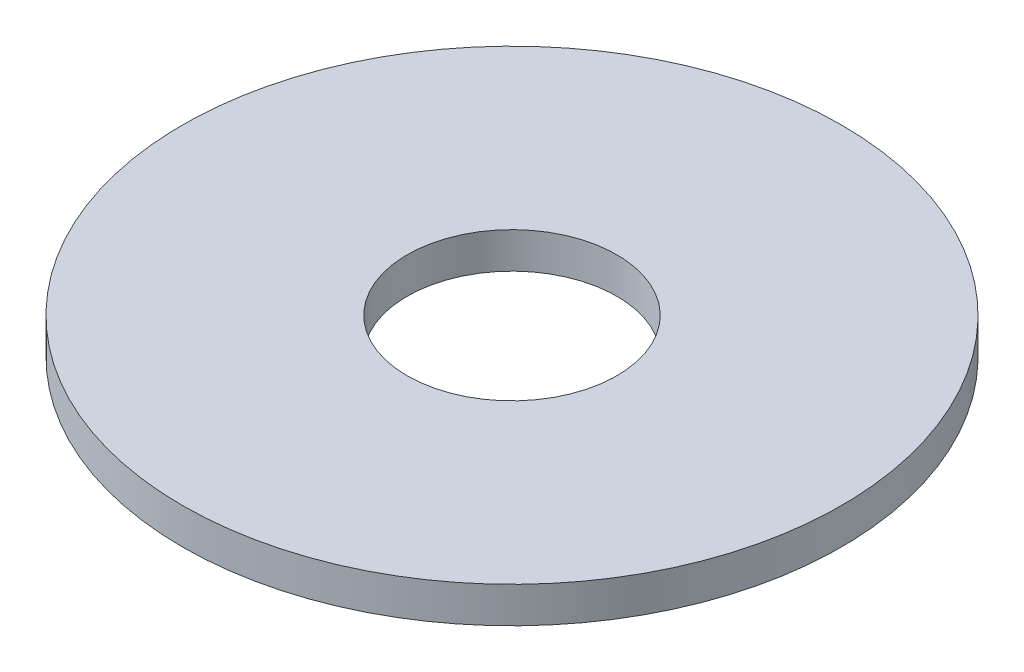
ISO-10303-21;
HEADER;
FILE_DESCRIPTION(('STEP AP214'),'2;1');
FILE_NAME('part.step','',(''),(''),'','','');
FILE_SCHEMA(('AUTOMOTIVE_DESIGN { 1 0 10303 214 1 1 1 1 }'));
ENDSEC;
DATA;
#1=APPLICATION_CONTEXT('core data for automotive mechanical design processes');
#2=APPLICATION_PROTOCOL_DEFINITION('international standard','automotive_design',2000,#1);
#3=PRODUCT_CONTEXT('',#1,'mechanical');
#4=PRODUCT('Part','Part','',(#3));
#5=PRODUCT_RELATED_PRODUCT_CATEGORY('part','',(#4));
#6=PRODUCT_DEFINITION_FORMATION('','',#4);
#7=PRODUCT_DEFINITION_CONTEXT('part definition',#1,'design');
#8=PRODUCT_DEFINITION('design','',#6,#7);
#9=PRODUCT_DEFINITION_SHAPE('','',#8);
#10=(LENGTH_UNIT() NAMED_UNIT(*) SI_UNIT(.MILLI.,.METRE.));
#11=(NAMED_UNIT(*) PLANE_ANGLE_UNIT() SI_UNIT($,.RADIAN.));
#12=(NAMED_UNIT(*) SI_UNIT($,.STERADIAN.) SOLID_ANGLE_UNIT());
#13=UNCERTAINTY_MEASURE_WITH_UNIT(LENGTH_MEASURE(1.E-05),#10,'distance_accuracy_value','');
#14=(GEOMETRIC_REPRESENTATION_CONTEXT(3) GLOBAL_UNCERTAINTY_ASSIGNED_CONTEXT((#13)) GLOBAL_UNIT_ASSIGNED_CONTEXT((#10,
#11,#12)) REPRESENTATION_CONTEXT('',''));
#15=CARTESIAN_POINT('',(0.,0.,0.));
#16=DIRECTION('',(0.,0.,1.));
#17=DIRECTION('',(1.,0.,0.));
#18=AXIS2_PLACEMENT_3D('',#15,#16,#17);
#19=CARTESIAN_POINT('',(0.,6.,0.));
#20=DIRECTION('',(0.,-1.,0.));
#21=DIRECTION('',(0.,0.,-1.));
#22=AXIS2_PLACEMENT_3D('',#19,#20,#21);
#23=CYLINDRICAL_SURFACE('',#22,55.);
#24=CARTESIAN_POINT('',(0.,6.,0.));
#25=DIRECTION('',(0.,1.,0.));
#26=DIRECTION('',(0.,0.,1.));
#27=AXIS2_PLACEMENT_3D('',#24,#25,#26);
#28=CIRCLE('',#27,55.);
#29=CARTESIAN_POINT('',(0.,6.,55.));
#30=VERTEX_POINT('',#29);
#31=EDGE_CURVE('E10',#30,#30,#28,.T.);
#32=ORIENTED_EDGE('',*,*,#31,.F.);
#33=EDGE_LOOP('',(#32));
#34=FACE_BOUND('',#33,.T.);
#35=CARTESIAN_POINT('',(0.,0.,0.));
#36=DIRECTION('',(0.,1.,0.));
#37=DIRECTION('',(0.,0.,1.));
#38=AXIS2_PLACEMENT_3D('',#35,#36,#37);
#39=CIRCLE('',#38,55.);
#40=CARTESIAN_POINT('',(0.,0.,55.));
#41=VERTEX_POINT('',#40);
#42=EDGE_CURVE('E37',#41,#41,#39,.T.);
#43=ORIENTED_EDGE('',*,*,#42,.T.);
#44=EDGE_LOOP('',(#43));
#45=FACE_BOUND('',#44,.T.);
#46=ADVANCED_FACE('F40',(#34,#45),#23,.T.);
#47=CARTESIAN_POINT('',(0.,6.,0.));
#48=DIRECTION('',(0.,1.,0.));
#49=DIRECTION('',(0.,0.,1.));
#50=AXIS2_PLACEMENT_3D('',#47,#48,#49);
#51=PLANE('',#50);
#52=CARTESIAN_POINT('',(0.,6.,0.));
#53=DIRECTION('',(0.,1.,0.));
#54=DIRECTION('',(0.,0.,1.));
#55=AXIS2_PLACEMENT_3D('',#52,#53,#54);
#56=CIRCLE('',#55,17.5);
#57=CARTESIAN_POINT('',(0.,6.,17.5));
#58=VERTEX_POINT('',#57);
#59=EDGE_CURVE('E50',#58,#58,#56,.T.);
#60=ORIENTED_EDGE('',*,*,#59,.F.);
#61=EDGE_LOOP('',(#60));
#62=FACE_BOUND('',#61,.T.);
#63=ORIENTED_EDGE('',*,*,#31,.T.);
#64=EDGE_LOOP('',(#63));
#65=FACE_BOUND('',#64,.T.);
#66=ADVANCED_FACE('F59',(#62,#65),#51,.T.);
#67=CARTESIAN_POINT('',(0.,0.,0.));
#68=DIRECTION('',(0.,1.,0.));
#69=DIRECTION('',(0.,0.,1.));
#70=AXIS2_PLACEMENT_3D('',#67,#68,#69);
#71=PLANE('',#70);
#72=CARTESIAN_POINT('',(0.,0.,0.));
#73=DIRECTION('',(0.,1.,0.));
#74=DIRECTION('',(0.,0.,1.));
#75=AXIS2_PLACEMENT_3D('',#72,#73,#74);
#76=CIRCLE('',#75,17.5);
#77=CARTESIAN_POINT('',(0.,0.,17.5));
#78=VERTEX_POINT('',#77);
#79=EDGE_CURVE('E47',#78,#78,#76,.T.);
#80=ORIENTED_EDGE('',*,*,#79,.T.);
#81=EDGE_LOOP('',(#80));
#82=FACE_BOUND('',#81,.T.);
#83=ORIENTED_EDGE('',*,*,#42,.F.);
#84=EDGE_LOOP('',(#83));
#85=FACE_BOUND('',#84,.T.);
#86=ADVANCED_FACE('F58',(#82,#85),#71,.F.);
#87=CARTESIAN_POINT('',(0.,6.,0.));
#88=DIRECTION('',(0.,-1.,0.));
#89=DIRECTION('',(0.,0.,-1.));
#90=AXIS2_PLACEMENT_3D('',#87,#88,#89);
#91=CYLINDRICAL_SURFACE('',#90,17.5);
#92=ORIENTED_EDGE('',*,*,#59,.T.);
#93=EDGE_LOOP('',(#92));
#94=FACE_BOUND('',#93,.T.);
#95=ORIENTED_EDGE('',*,*,#79,.F.);
#96=EDGE_LOOP('',(#95));
#97=FACE_BOUND('',#96,.T.);
#98=ADVANCED_FACE('F54',(#94,#97),#91,.F.);
#99=CLOSED_SHELL('',(#46,#66,#86,#98));
#100=MANIFOLD_SOLID_BREP('B2',#99);
#101=ADVANCED_BREP_SHAPE_REPRESENTATION('',(#18,#100),#14);
#102=SHAPE_DEFINITION_REPRESENTATION(#9,#101);
ENDSEC;
END-ISO-10303-21;
